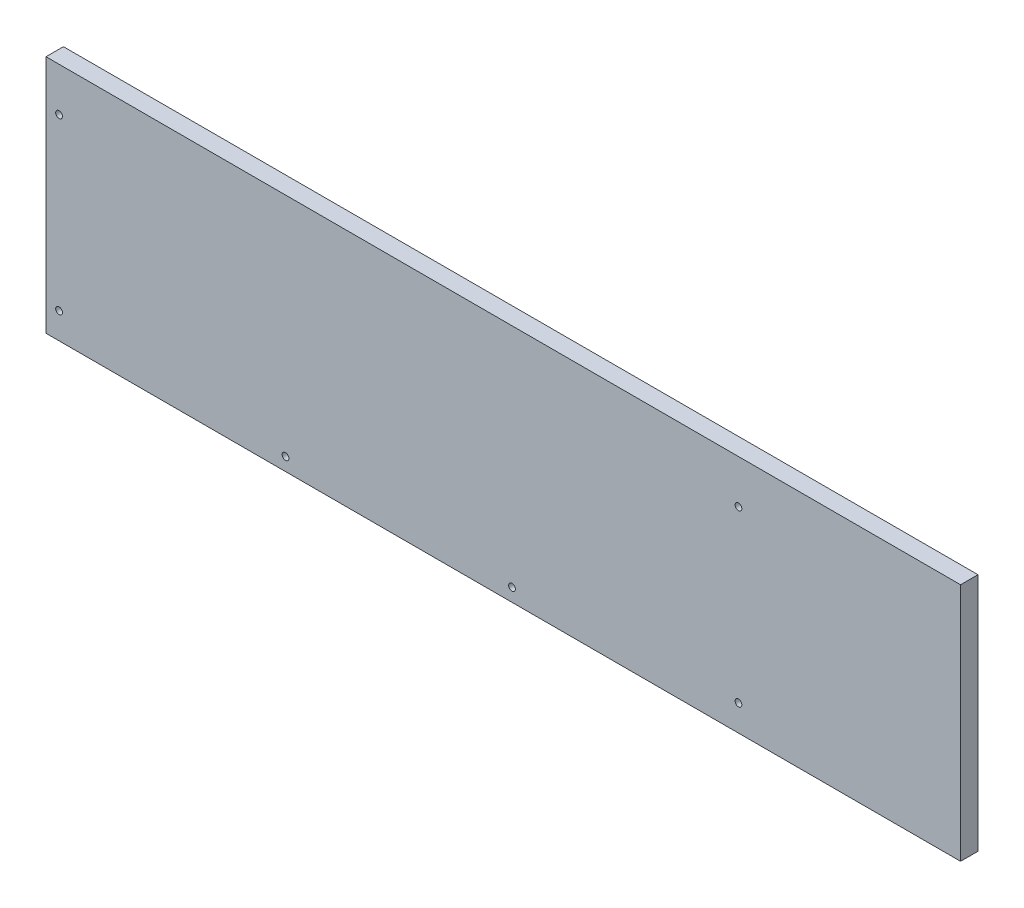
ISO-10303-21;
HEADER;
FILE_DESCRIPTION(('STEP AP214'),'2;1');
FILE_NAME('part.step','',(''),(''),'','','');
FILE_SCHEMA(('AUTOMOTIVE_DESIGN { 1 0 10303 214 1 1 1 1 }'));
ENDSEC;
DATA;
#1=APPLICATION_CONTEXT('core data for automotive mechanical design processes');
#2=APPLICATION_PROTOCOL_DEFINITION('international standard','automotive_design',2000,#1);
#3=PRODUCT_CONTEXT('',#1,'mechanical');
#4=PRODUCT('Part','Part','',(#3));
#5=PRODUCT_RELATED_PRODUCT_CATEGORY('part','',(#4));
#6=PRODUCT_DEFINITION_FORMATION('','',#4);
#7=PRODUCT_DEFINITION_CONTEXT('part definition',#1,'design');
#8=PRODUCT_DEFINITION('design','',#6,#7);
#9=PRODUCT_DEFINITION_SHAPE('','',#8);
#10=(LENGTH_UNIT() NAMED_UNIT(*) SI_UNIT(.MILLI.,.METRE.));
#11=(NAMED_UNIT(*) PLANE_ANGLE_UNIT() SI_UNIT($,.RADIAN.));
#12=(NAMED_UNIT(*) SI_UNIT($,.STERADIAN.) SOLID_ANGLE_UNIT());
#13=UNCERTAINTY_MEASURE_WITH_UNIT(LENGTH_MEASURE(1.E-05),#10,'distance_accuracy_value','');
#14=(GEOMETRIC_REPRESENTATION_CONTEXT(3) GLOBAL_UNCERTAINTY_ASSIGNED_CONTEXT((#13)) GLOBAL_UNIT_ASSIGNED_CONTEXT((#10,
#11,#12)) REPRESENTATION_CONTEXT('',''));
#15=CARTESIAN_POINT('',(0.,0.,0.));
#16=DIRECTION('',(0.,0.,1.));
#17=DIRECTION('',(1.,0.,0.));
#18=AXIS2_PLACEMENT_3D('',#15,#16,#17);
#19=CARTESIAN_POINT('',(0.,0.,8.));
#20=DIRECTION('',(0.,0.,1.));
#21=DIRECTION('',(1.,0.,0.));
#22=AXIS2_PLACEMENT_3D('',#19,#20,#21);
#23=PLANE('',#22);
#24=CARTESIAN_POINT('',(108.,-43.,8.));
#25=DIRECTION('',(0.,0.,1.));
#26=DIRECTION('',(1.,0.,0.));
#27=AXIS2_PLACEMENT_3D('',#24,#25,#26);
#28=CIRCLE('',#27,1.54999999999999);
#29=CARTESIAN_POINT('',(109.55,-43.,8.));
#30=VERTEX_POINT('',#29);
#31=EDGE_CURVE('E133',#30,#30,#28,.T.);
#32=ORIENTED_EDGE('',*,*,#31,.F.);
#33=EDGE_LOOP('',(#32));
#34=FACE_BOUND('',#33,.T.);
#35=CARTESIAN_POINT('',(-100.,-49.,8.));
#36=DIRECTION('',(0.,0.,1.));
#37=DIRECTION('',(1.,0.,0.));
#38=AXIS2_PLACEMENT_3D('',#35,#36,#37);
#39=CIRCLE('',#38,1.54999999999999);
#40=CARTESIAN_POINT('',(-98.45,-49.,8.));
#41=VERTEX_POINT('',#40);
#42=EDGE_CURVE('E121',#41,#41,#39,.T.);
#43=ORIENTED_EDGE('',*,*,#42,.F.);
#44=EDGE_LOOP('',(#43));
#45=FACE_BOUND('',#44,.T.);
#46=CARTESIAN_POINT('',(-204.,35.,8.));
#47=DIRECTION('',(0.,0.,1.));
#48=DIRECTION('',(1.,0.,0.));
#49=AXIS2_PLACEMENT_3D('',#46,#47,#48);
#50=CIRCLE('',#49,1.54999999999999);
#51=CARTESIAN_POINT('',(-202.45,35.,8.));
#52=VERTEX_POINT('',#51);
#53=EDGE_CURVE('E100',#52,#52,#50,.T.);
#54=ORIENTED_EDGE('',*,*,#53,.F.);
#55=EDGE_LOOP('',(#54));
#56=FACE_BOUND('',#55,.T.);
#57=DIRECTION('',(0.,1.,0.));
#58=VECTOR('',#57,1.);
#59=CARTESIAN_POINT('',(210.,55.,8.));
#60=LINE('',#59,#58);
#61=CARTESIAN_POINT('',(210.,-55.,8.));
#62=VERTEX_POINT('',#61);
#63=CARTESIAN_POINT('',(210.,55.,8.));
#64=VERTEX_POINT('',#63);
#65=EDGE_CURVE('E85',#62,#64,#60,.T.);
#66=ORIENTED_EDGE('',*,*,#65,.T.);
#67=DIRECTION('',(-1.,0.,0.));
#68=VECTOR('',#67,1.);
#69=CARTESIAN_POINT('',(-210.,55.,8.));
#70=LINE('',#69,#68);
#71=CARTESIAN_POINT('',(-210.,55.,8.));
#72=VERTEX_POINT('',#71);
#73=EDGE_CURVE('E80',#64,#72,#70,.T.);
#74=ORIENTED_EDGE('',*,*,#73,.T.);
#75=DIRECTION('',(0.,-1.,0.));
#76=VECTOR('',#75,1.);
#77=CARTESIAN_POINT('',(-210.,55.,8.));
#78=LINE('',#77,#76);
#79=CARTESIAN_POINT('',(-210.,-55.,8.));
#80=VERTEX_POINT('',#79);
#81=EDGE_CURVE('E83',#72,#80,#78,.T.);
#82=ORIENTED_EDGE('',*,*,#81,.T.);
#83=DIRECTION('',(1.,0.,0.));
#84=VECTOR('',#83,1.);
#85=CARTESIAN_POINT('',(-210.,-55.,8.));
#86=LINE('',#85,#84);
#87=EDGE_CURVE('E50',#80,#62,#86,.T.);
#88=ORIENTED_EDGE('',*,*,#87,.T.);
#89=EDGE_LOOP('',(#66,#74,#82,#88));
#90=FACE_BOUND('',#89,.T.);
#91=CARTESIAN_POINT('',(-204.,-43.,8.));
#92=DIRECTION('',(0.,0.,1.));
#93=DIRECTION('',(1.,0.,0.));
#94=AXIS2_PLACEMENT_3D('',#91,#92,#93);
#95=CIRCLE('',#94,1.54999999999999);
#96=CARTESIAN_POINT('',(-202.45,-43.,8.));
#97=VERTEX_POINT('',#96);
#98=EDGE_CURVE('E115',#97,#97,#95,.T.);
#99=ORIENTED_EDGE('',*,*,#98,.F.);
#100=EDGE_LOOP('',(#99));
#101=FACE_BOUND('',#100,.T.);
#102=CARTESIAN_POINT('',(3.99999999999998,-49.,8.));
#103=DIRECTION('',(0.,0.,1.));
#104=DIRECTION('',(1.,0.,0.));
#105=AXIS2_PLACEMENT_3D('',#102,#103,#104);
#106=CIRCLE('',#105,1.55);
#107=CARTESIAN_POINT('',(5.54999999999998,-49.,8.));
#108=VERTEX_POINT('',#107);
#109=EDGE_CURVE('E127',#108,#108,#106,.T.);
#110=ORIENTED_EDGE('',*,*,#109,.F.);
#111=EDGE_LOOP('',(#110));
#112=FACE_BOUND('',#111,.T.);
#113=CARTESIAN_POINT('',(108.,35.,8.));
#114=DIRECTION('',(0.,0.,1.));
#115=DIRECTION('',(1.,0.,0.));
#116=AXIS2_PLACEMENT_3D('',#113,#114,#115);
#117=CIRCLE('',#116,1.54999999999999);
#118=CARTESIAN_POINT('',(109.55,35.,8.));
#119=VERTEX_POINT('',#118);
#120=EDGE_CURVE('E139',#119,#119,#117,.T.);
#121=ORIENTED_EDGE('',*,*,#120,.F.);
#122=EDGE_LOOP('',(#121));
#123=FACE_BOUND('',#122,.T.);
#124=ADVANCED_FACE('F33',(#34,#45,#56,#90,#101,#112,#123),#23,.T.);
#125=CARTESIAN_POINT('',(0.,0.,0.));
#126=DIRECTION('',(0.,0.,1.));
#127=DIRECTION('',(1.,0.,0.));
#128=AXIS2_PLACEMENT_3D('',#125,#126,#127);
#129=PLANE('',#128);
#130=CARTESIAN_POINT('',(108.,-43.,0.));
#131=DIRECTION('',(0.,0.,1.));
#132=DIRECTION('',(1.,0.,0.));
#133=AXIS2_PLACEMENT_3D('',#130,#131,#132);
#134=CIRCLE('',#133,1.54999999999999);
#135=CARTESIAN_POINT('',(109.55,-43.,0.));
#136=VERTEX_POINT('',#135);
#137=EDGE_CURVE('E136',#136,#136,#134,.T.);
#138=ORIENTED_EDGE('',*,*,#137,.T.);
#139=EDGE_LOOP('',(#138));
#140=FACE_BOUND('',#139,.T.);
#141=CARTESIAN_POINT('',(-100.,-49.,0.));
#142=DIRECTION('',(0.,0.,1.));
#143=DIRECTION('',(1.,0.,0.));
#144=AXIS2_PLACEMENT_3D('',#141,#142,#143);
#145=CIRCLE('',#144,1.54999999999999);
#146=CARTESIAN_POINT('',(-98.45,-49.,0.));
#147=VERTEX_POINT('',#146);
#148=EDGE_CURVE('E124',#147,#147,#145,.T.);
#149=ORIENTED_EDGE('',*,*,#148,.T.);
#150=EDGE_LOOP('',(#149));
#151=FACE_BOUND('',#150,.T.);
#152=CARTESIAN_POINT('',(-204.,35.,0.));
#153=DIRECTION('',(0.,0.,1.));
#154=DIRECTION('',(1.,0.,0.));
#155=AXIS2_PLACEMENT_3D('',#152,#153,#154);
#156=CIRCLE('',#155,1.54999999999999);
#157=CARTESIAN_POINT('',(-202.45,35.,0.));
#158=VERTEX_POINT('',#157);
#159=EDGE_CURVE('E112',#158,#158,#156,.T.);
#160=ORIENTED_EDGE('',*,*,#159,.T.);
#161=EDGE_LOOP('',(#160));
#162=FACE_BOUND('',#161,.T.);
#163=DIRECTION('',(0.,1.,0.));
#164=VECTOR('',#163,1.);
#165=CARTESIAN_POINT('',(210.,55.,0.));
#166=LINE('',#165,#164);
#167=CARTESIAN_POINT('',(210.,-55.,0.));
#168=VERTEX_POINT('',#167);
#169=CARTESIAN_POINT('',(210.,55.,0.));
#170=VERTEX_POINT('',#169);
#171=EDGE_CURVE('E97',#168,#170,#166,.T.);
#172=ORIENTED_EDGE('',*,*,#171,.F.);
#173=DIRECTION('',(1.,0.,0.));
#174=VECTOR('',#173,1.);
#175=CARTESIAN_POINT('',(-210.,-55.,0.));
#176=LINE('',#175,#174);
#177=CARTESIAN_POINT('',(-210.,-55.,0.));
#178=VERTEX_POINT('',#177);
#179=EDGE_CURVE('E73',#178,#168,#176,.T.);
#180=ORIENTED_EDGE('',*,*,#179,.F.);
#181=DIRECTION('',(0.,-1.,0.));
#182=VECTOR('',#181,1.);
#183=CARTESIAN_POINT('',(-210.,55.,0.));
#184=LINE('',#183,#182);
#185=CARTESIAN_POINT('',(-210.,55.,0.));
#186=VERTEX_POINT('',#185);
#187=EDGE_CURVE('E67',#186,#178,#184,.T.);
#188=ORIENTED_EDGE('',*,*,#187,.F.);
#189=DIRECTION('',(-1.,0.,0.));
#190=VECTOR('',#189,1.);
#191=CARTESIAN_POINT('',(-210.,55.,0.));
#192=LINE('',#191,#190);
#193=EDGE_CURVE('E89',#170,#186,#192,.T.);
#194=ORIENTED_EDGE('',*,*,#193,.F.);
#195=EDGE_LOOP('',(#172,#180,#188,#194));
#196=FACE_BOUND('',#195,.T.);
#197=CARTESIAN_POINT('',(-204.,-43.,0.));
#198=DIRECTION('',(0.,0.,1.));
#199=DIRECTION('',(1.,0.,0.));
#200=AXIS2_PLACEMENT_3D('',#197,#198,#199);
#201=CIRCLE('',#200,1.54999999999999);
#202=CARTESIAN_POINT('',(-202.45,-43.,0.));
#203=VERTEX_POINT('',#202);
#204=EDGE_CURVE('E118',#203,#203,#201,.T.);
#205=ORIENTED_EDGE('',*,*,#204,.T.);
#206=EDGE_LOOP('',(#205));
#207=FACE_BOUND('',#206,.T.);
#208=CARTESIAN_POINT('',(3.99999999999998,-49.,0.));
#209=DIRECTION('',(0.,0.,1.));
#210=DIRECTION('',(1.,0.,0.));
#211=AXIS2_PLACEMENT_3D('',#208,#209,#210);
#212=CIRCLE('',#211,1.55);
#213=CARTESIAN_POINT('',(5.54999999999998,-49.,0.));
#214=VERTEX_POINT('',#213);
#215=EDGE_CURVE('E130',#214,#214,#212,.T.);
#216=ORIENTED_EDGE('',*,*,#215,.T.);
#217=EDGE_LOOP('',(#216));
#218=FACE_BOUND('',#217,.T.);
#219=CARTESIAN_POINT('',(108.,35.,0.));
#220=DIRECTION('',(0.,0.,1.));
#221=DIRECTION('',(1.,0.,0.));
#222=AXIS2_PLACEMENT_3D('',#219,#220,#221);
#223=CIRCLE('',#222,1.54999999999999);
#224=CARTESIAN_POINT('',(109.55,35.,0.));
#225=VERTEX_POINT('',#224);
#226=EDGE_CURVE('E142',#225,#225,#223,.T.);
#227=ORIENTED_EDGE('',*,*,#226,.T.);
#228=EDGE_LOOP('',(#227));
#229=FACE_BOUND('',#228,.T.);
#230=ADVANCED_FACE('F108',(#140,#151,#162,#196,#207,#218,#229),#129,.F.);
#231=CARTESIAN_POINT('',(210.,55.,8.));
#232=DIRECTION('',(-1.,0.,0.));
#233=DIRECTION('',(0.,0.,1.));
#234=AXIS2_PLACEMENT_3D('',#231,#232,#233);
#235=PLANE('',#234);
#236=ORIENTED_EDGE('',*,*,#171,.T.);
#237=DIRECTION('',(0.,0.,-1.));
#238=VECTOR('',#237,1.);
#239=CARTESIAN_POINT('',(210.,55.,8.));
#240=LINE('',#239,#238);
#241=EDGE_CURVE('E11',#64,#170,#240,.T.);
#242=ORIENTED_EDGE('',*,*,#241,.F.);
#243=ORIENTED_EDGE('',*,*,#65,.F.);
#244=DIRECTION('',(0.,0.,-1.));
#245=VECTOR('',#244,1.);
#246=CARTESIAN_POINT('',(210.,-55.,8.));
#247=LINE('',#246,#245);
#248=EDGE_CURVE('E93',#62,#168,#247,.T.);
#249=ORIENTED_EDGE('',*,*,#248,.T.);
#250=EDGE_LOOP('',(#236,#242,#243,#249));
#251=FACE_BOUND('',#250,.T.);
#252=ADVANCED_FACE('F35',(#251),#235,.F.);
#253=CARTESIAN_POINT('',(-210.,55.,8.));
#254=DIRECTION('',(0.,-1.,0.));
#255=DIRECTION('',(0.,0.,-1.));
#256=AXIS2_PLACEMENT_3D('',#253,#254,#255);
#257=PLANE('',#256);
#258=ORIENTED_EDGE('',*,*,#193,.T.);
#259=DIRECTION('',(0.,0.,-1.));
#260=VECTOR('',#259,1.);
#261=CARTESIAN_POINT('',(-210.,55.,8.));
#262=LINE('',#261,#260);
#263=EDGE_CURVE('E42',#72,#186,#262,.T.);
#264=ORIENTED_EDGE('',*,*,#263,.F.);
#265=ORIENTED_EDGE('',*,*,#73,.F.);
#266=ORIENTED_EDGE('',*,*,#241,.T.);
#267=EDGE_LOOP('',(#258,#264,#265,#266));
#268=FACE_BOUND('',#267,.T.);
#269=ADVANCED_FACE('F88',(#268),#257,.F.);
#270=CARTESIAN_POINT('',(-210.,55.,8.));
#271=DIRECTION('',(1.,0.,0.));
#272=DIRECTION('',(0.,0.,-1.));
#273=AXIS2_PLACEMENT_3D('',#270,#271,#272);
#274=PLANE('',#273);
#275=ORIENTED_EDGE('',*,*,#187,.T.);
#276=DIRECTION('',(0.,0.,-1.));
#277=VECTOR('',#276,1.);
#278=CARTESIAN_POINT('',(-210.,-55.,8.));
#279=LINE('',#278,#277);
#280=EDGE_CURVE('E90',#80,#178,#279,.T.);
#281=ORIENTED_EDGE('',*,*,#280,.F.);
#282=ORIENTED_EDGE('',*,*,#81,.F.);
#283=ORIENTED_EDGE('',*,*,#263,.T.);
#284=EDGE_LOOP('',(#275,#281,#282,#283));
#285=FACE_BOUND('',#284,.T.);
#286=ADVANCED_FACE('F91',(#285),#274,.F.);
#287=CARTESIAN_POINT('',(-210.,-55.,8.));
#288=DIRECTION('',(0.,1.,0.));
#289=DIRECTION('',(0.,0.,1.));
#290=AXIS2_PLACEMENT_3D('',#287,#288,#289);
#291=PLANE('',#290);
#292=ORIENTED_EDGE('',*,*,#179,.T.);
#293=ORIENTED_EDGE('',*,*,#248,.F.);
#294=ORIENTED_EDGE('',*,*,#87,.F.);
#295=ORIENTED_EDGE('',*,*,#280,.T.);
#296=EDGE_LOOP('',(#292,#293,#294,#295));
#297=FACE_BOUND('',#296,.T.);
#298=ADVANCED_FACE('F105',(#297),#291,.F.);
#299=CARTESIAN_POINT('',(-204.,35.,8.));
#300=DIRECTION('',(0.,0.,-1.));
#301=DIRECTION('',(-1.,0.,0.));
#302=AXIS2_PLACEMENT_3D('',#299,#300,#301);
#303=CYLINDRICAL_SURFACE('',#302,1.54999999999999);
#304=ORIENTED_EDGE('',*,*,#53,.T.);
#305=EDGE_LOOP('',(#304));
#306=FACE_BOUND('',#305,.T.);
#307=ORIENTED_EDGE('',*,*,#159,.F.);
#308=EDGE_LOOP('',(#307));
#309=FACE_BOUND('',#308,.T.);
#310=ADVANCED_FACE('F162',(#306,#309),#303,.F.);
#311=CARTESIAN_POINT('',(-204.,-43.,8.));
#312=DIRECTION('',(0.,0.,-1.));
#313=DIRECTION('',(-1.,0.,0.));
#314=AXIS2_PLACEMENT_3D('',#311,#312,#313);
#315=CYLINDRICAL_SURFACE('',#314,1.54999999999999);
#316=ORIENTED_EDGE('',*,*,#98,.T.);
#317=EDGE_LOOP('',(#316));
#318=FACE_BOUND('',#317,.T.);
#319=ORIENTED_EDGE('',*,*,#204,.F.);
#320=EDGE_LOOP('',(#319));
#321=FACE_BOUND('',#320,.T.);
#322=ADVANCED_FACE('F191',(#318,#321),#315,.F.);
#323=CARTESIAN_POINT('',(-100.,-49.,8.));
#324=DIRECTION('',(0.,0.,-1.));
#325=DIRECTION('',(-1.,0.,0.));
#326=AXIS2_PLACEMENT_3D('',#323,#324,#325);
#327=CYLINDRICAL_SURFACE('',#326,1.54999999999999);
#328=ORIENTED_EDGE('',*,*,#42,.T.);
#329=EDGE_LOOP('',(#328));
#330=FACE_BOUND('',#329,.T.);
#331=ORIENTED_EDGE('',*,*,#148,.F.);
#332=EDGE_LOOP('',(#331));
#333=FACE_BOUND('',#332,.T.);
#334=ADVANCED_FACE('F200',(#330,#333),#327,.F.);
#335=CARTESIAN_POINT('',(3.99999999999998,-49.,8.));
#336=DIRECTION('',(0.,0.,-1.));
#337=DIRECTION('',(-1.,0.,0.));
#338=AXIS2_PLACEMENT_3D('',#335,#336,#337);
#339=CYLINDRICAL_SURFACE('',#338,1.55);
#340=ORIENTED_EDGE('',*,*,#109,.T.);
#341=EDGE_LOOP('',(#340));
#342=FACE_BOUND('',#341,.T.);
#343=ORIENTED_EDGE('',*,*,#215,.F.);
#344=EDGE_LOOP('',(#343));
#345=FACE_BOUND('',#344,.T.);
#346=ADVANCED_FACE('F209',(#342,#345),#339,.F.);
#347=CARTESIAN_POINT('',(108.,-43.,8.));
#348=DIRECTION('',(0.,0.,-1.));
#349=DIRECTION('',(-1.,0.,0.));
#350=AXIS2_PLACEMENT_3D('',#347,#348,#349);
#351=CYLINDRICAL_SURFACE('',#350,1.54999999999999);
#352=ORIENTED_EDGE('',*,*,#31,.T.);
#353=EDGE_LOOP('',(#352));
#354=FACE_BOUND('',#353,.T.);
#355=ORIENTED_EDGE('',*,*,#137,.F.);
#356=EDGE_LOOP('',(#355));
#357=FACE_BOUND('',#356,.T.);
#358=ADVANCED_FACE('F219',(#354,#357),#351,.F.);
#359=CARTESIAN_POINT('',(108.,35.,8.));
#360=DIRECTION('',(0.,0.,-1.));
#361=DIRECTION('',(-1.,0.,0.));
#362=AXIS2_PLACEMENT_3D('',#359,#360,#361);
#363=CYLINDRICAL_SURFACE('',#362,1.54999999999999);
#364=ORIENTED_EDGE('',*,*,#120,.T.);
#365=EDGE_LOOP('',(#364));
#366=FACE_BOUND('',#365,.T.);
#367=ORIENTED_EDGE('',*,*,#226,.F.);
#368=EDGE_LOOP('',(#367));
#369=FACE_BOUND('',#368,.T.);
#370=ADVANCED_FACE('F148',(#366,#369),#363,.F.);
#371=CLOSED_SHELL('',(#124,#230,#252,#269,#286,#298,#310,#322,#334,#346,#358,#370));
#372=MANIFOLD_SOLID_BREP('B2',#371);
#373=ADVANCED_BREP_SHAPE_REPRESENTATION('',(#18,#372),#14);
#374=SHAPE_DEFINITION_REPRESENTATION(#9,#373);
ENDSEC;
END-ISO-10303-21;
